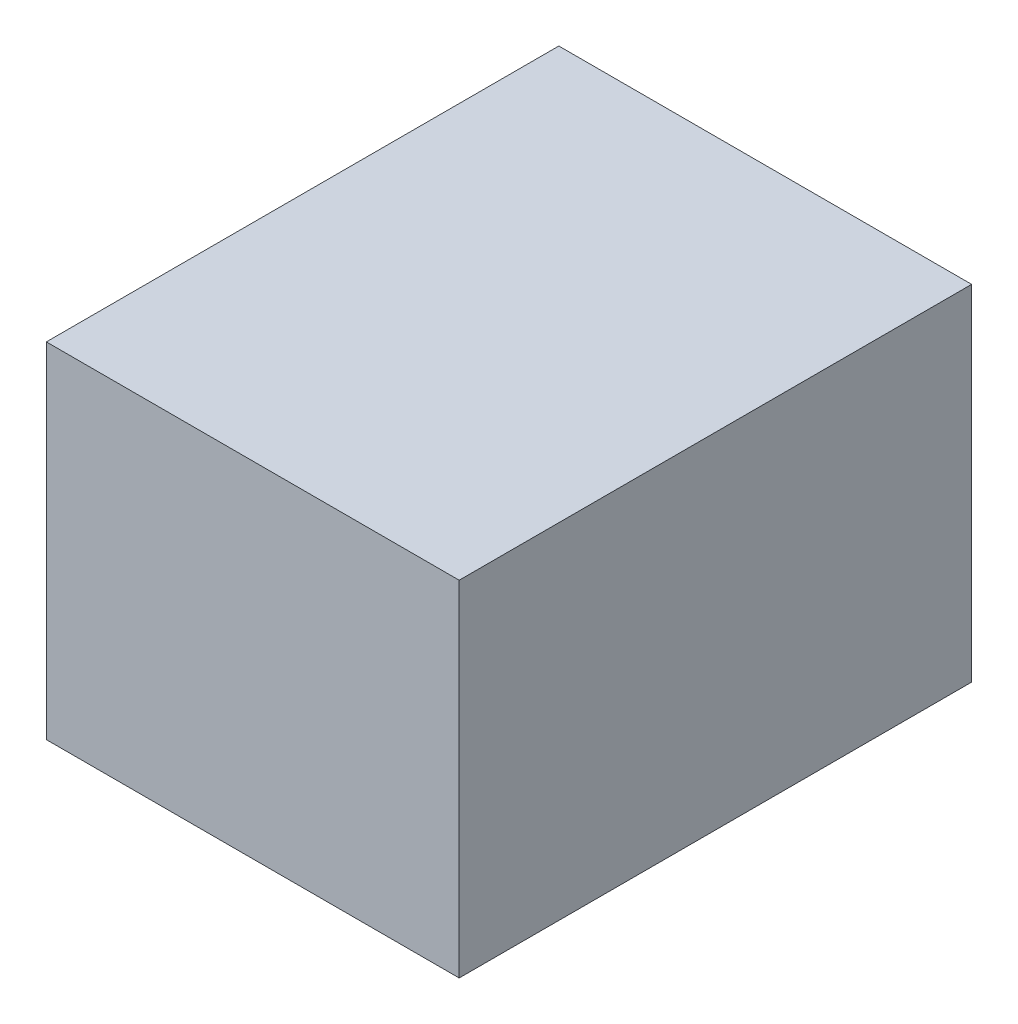
ISO-10303-21;
HEADER;
FILE_DESCRIPTION(('STEP AP214'),'2;1');
FILE_NAME('part.step','',(''),(''),'','','');
FILE_SCHEMA(('AUTOMOTIVE_DESIGN { 1 0 10303 214 1 1 1 1 }'));
ENDSEC;
DATA;
#1=APPLICATION_CONTEXT('core data for automotive mechanical design processes');
#2=APPLICATION_PROTOCOL_DEFINITION('international standard','automotive_design',2000,#1);
#3=PRODUCT_CONTEXT('',#1,'mechanical');
#4=PRODUCT('Part','Part','',(#3));
#5=PRODUCT_RELATED_PRODUCT_CATEGORY('part','',(#4));
#6=PRODUCT_DEFINITION_FORMATION('','',#4);
#7=PRODUCT_DEFINITION_CONTEXT('part definition',#1,'design');
#8=PRODUCT_DEFINITION('design','',#6,#7);
#9=PRODUCT_DEFINITION_SHAPE('','',#8);
#10=(LENGTH_UNIT() NAMED_UNIT(*) SI_UNIT(.MILLI.,.METRE.));
#11=(NAMED_UNIT(*) PLANE_ANGLE_UNIT() SI_UNIT($,.RADIAN.));
#12=(NAMED_UNIT(*) SI_UNIT($,.STERADIAN.) SOLID_ANGLE_UNIT());
#13=UNCERTAINTY_MEASURE_WITH_UNIT(LENGTH_MEASURE(1.E-05),#10,'distance_accuracy_value','');
#14=(GEOMETRIC_REPRESENTATION_CONTEXT(3) GLOBAL_UNCERTAINTY_ASSIGNED_CONTEXT((#13)) GLOBAL_UNIT_ASSIGNED_CONTEXT((#10,
#11,#12)) REPRESENTATION_CONTEXT('',''));
#15=CARTESIAN_POINT('',(0.,0.,0.));
#16=DIRECTION('',(0.,0.,1.));
#17=DIRECTION('',(1.,0.,0.));
#18=AXIS2_PLACEMENT_3D('',#15,#16,#17);
#19=CARTESIAN_POINT('',(-0.72499982,0.60500006,0.));
#20=DIRECTION('',(0.,1.,0.));
#21=DIRECTION('',(0.,0.,1.));
#22=AXIS2_PLACEMENT_3D('',#19,#20,#21);
#23=PLANE('',#22);
#24=DIRECTION('',(0.,0.,-1.));
#25=VECTOR('',#24,1.);
#26=CARTESIAN_POINT('',(0.72499982,0.60500006,0.));
#27=LINE('',#26,#25);
#28=CARTESIAN_POINT('',(0.72499982,0.60500006,0.));
#29=VERTEX_POINT('',#28);
#30=CARTESIAN_POINT('',(0.72499982,0.60500006,1.79999894));
#31=VERTEX_POINT('',#30);
#32=EDGE_CURVE('E61',#29,#31,#27,.F.);
#33=ORIENTED_EDGE('',*,*,#32,.F.);
#34=DIRECTION('',(1.,0.,0.));
#35=VECTOR('',#34,1.);
#36=CARTESIAN_POINT('',(-0.72499982,0.60500006,0.));
#37=LINE('',#36,#35);
#38=CARTESIAN_POINT('',(-0.72499982,0.60500006,0.));
#39=VERTEX_POINT('',#38);
#40=EDGE_CURVE('E19',#29,#39,#37,.F.);
#41=ORIENTED_EDGE('',*,*,#40,.T.);
#42=DIRECTION('',(0.,0.,1.));
#43=VECTOR('',#42,1.);
#44=CARTESIAN_POINT('',(-0.72499982,0.60500006,0.));
#45=LINE('',#44,#43);
#46=CARTESIAN_POINT('',(-0.72499982,0.60500006,1.79999894));
#47=VERTEX_POINT('',#46);
#48=EDGE_CURVE('E68',#47,#39,#45,.F.);
#49=ORIENTED_EDGE('',*,*,#48,.F.);
#50=DIRECTION('',(1.,0.,0.));
#51=VECTOR('',#50,1.);
#52=CARTESIAN_POINT('',(0.72499982,0.60500006,1.79999894));
#53=LINE('',#52,#51);
#54=EDGE_CURVE('E55',#31,#47,#53,.F.);
#55=ORIENTED_EDGE('',*,*,#54,.F.);
#56=EDGE_LOOP('',(#33,#41,#49,#55));
#57=FACE_BOUND('',#56,.T.);
#58=ADVANCED_FACE('F16',(#57),#23,.T.);
#59=CARTESIAN_POINT('',(0.72499982,0.60500006,0.));
#60=DIRECTION('',(1.,0.,0.));
#61=DIRECTION('',(0.,0.,-1.));
#62=AXIS2_PLACEMENT_3D('',#59,#60,#61);
#63=PLANE('',#62);
#64=DIRECTION('',(0.,0.,-1.));
#65=VECTOR('',#64,1.);
#66=CARTESIAN_POINT('',(0.72499982,-0.60500006,0.));
#67=LINE('',#66,#65);
#68=CARTESIAN_POINT('',(0.72499982,-0.60500006,0.));
#69=VERTEX_POINT('',#68);
#70=CARTESIAN_POINT('',(0.72499982,-0.60500006,1.79999894));
#71=VERTEX_POINT('',#70);
#72=EDGE_CURVE('E82',#69,#71,#67,.F.);
#73=ORIENTED_EDGE('',*,*,#72,.F.);
#74=DIRECTION('',(0.,1.,0.));
#75=VECTOR('',#74,1.);
#76=CARTESIAN_POINT('',(0.72499982,-0.60500006,0.));
#77=LINE('',#76,#75);
#78=EDGE_CURVE('E66',#69,#29,#77,.T.);
#79=ORIENTED_EDGE('',*,*,#78,.T.);
#80=ORIENTED_EDGE('',*,*,#32,.T.);
#81=DIRECTION('',(0.,1.,0.));
#82=VECTOR('',#81,1.);
#83=CARTESIAN_POINT('',(0.72499982,-0.60500006,1.79999894));
#84=LINE('',#83,#82);
#85=EDGE_CURVE('E63',#71,#31,#84,.T.);
#86=ORIENTED_EDGE('',*,*,#85,.F.);
#87=EDGE_LOOP('',(#73,#79,#80,#86));
#88=FACE_BOUND('',#87,.T.);
#89=ADVANCED_FACE('F62',(#88),#63,.T.);
#90=CARTESIAN_POINT('',(0.72499982,-0.60500006,1.79999894));
#91=DIRECTION('',(0.,0.,1.));
#92=DIRECTION('',(1.,0.,0.));
#93=AXIS2_PLACEMENT_3D('',#90,#91,#92);
#94=PLANE('',#93);
#95=DIRECTION('',(0.,1.,0.));
#96=VECTOR('',#95,1.);
#97=CARTESIAN_POINT('',(-0.72499982,-0.60500006,1.79999894));
#98=LINE('',#97,#96);
#99=CARTESIAN_POINT('',(-0.72499982,-0.60500006,1.79999894));
#100=VERTEX_POINT('',#99);
#101=EDGE_CURVE('E70',#100,#47,#98,.T.);
#102=ORIENTED_EDGE('',*,*,#101,.F.);
#103=DIRECTION('',(1.,0.,0.));
#104=VECTOR('',#103,1.);
#105=CARTESIAN_POINT('',(0.72499982,-0.60500006,1.79999894));
#106=LINE('',#105,#104);
#107=EDGE_CURVE('E74',#71,#100,#106,.F.);
#108=ORIENTED_EDGE('',*,*,#107,.F.);
#109=ORIENTED_EDGE('',*,*,#85,.T.);
#110=ORIENTED_EDGE('',*,*,#54,.T.);
#111=EDGE_LOOP('',(#102,#108,#109,#110));
#112=FACE_BOUND('',#111,.T.);
#113=ADVANCED_FACE('F72',(#112),#94,.T.);
#114=CARTESIAN_POINT('',(-0.72499982,-0.60500006,0.));
#115=DIRECTION('',(-1.,0.,0.));
#116=DIRECTION('',(0.,0.,1.));
#117=AXIS2_PLACEMENT_3D('',#114,#115,#116);
#118=PLANE('',#117);
#119=ORIENTED_EDGE('',*,*,#48,.T.);
#120=DIRECTION('',(0.,1.,0.));
#121=VECTOR('',#120,1.);
#122=CARTESIAN_POINT('',(-0.72499982,-0.60500006,0.));
#123=LINE('',#122,#121);
#124=CARTESIAN_POINT('',(-0.72499982,-0.60500006,0.));
#125=VERTEX_POINT('',#124);
#126=EDGE_CURVE('E34',#39,#125,#123,.F.);
#127=ORIENTED_EDGE('',*,*,#126,.T.);
#128=DIRECTION('',(0.,0.,-1.));
#129=VECTOR('',#128,1.);
#130=CARTESIAN_POINT('',(-0.72499982,-0.60500006,0.));
#131=LINE('',#130,#129);
#132=EDGE_CURVE('E25',#100,#125,#131,.T.);
#133=ORIENTED_EDGE('',*,*,#132,.F.);
#134=ORIENTED_EDGE('',*,*,#101,.T.);
#135=EDGE_LOOP('',(#119,#127,#133,#134));
#136=FACE_BOUND('',#135,.T.);
#137=ADVANCED_FACE('F88',(#136),#118,.T.);
#138=CARTESIAN_POINT('',(0.72499982,-0.60500006,0.));
#139=DIRECTION('',(0.,0.,1.));
#140=DIRECTION('',(1.,0.,0.));
#141=AXIS2_PLACEMENT_3D('',#138,#139,#140);
#142=PLANE('',#141);
#143=ORIENTED_EDGE('',*,*,#126,.F.);
#144=ORIENTED_EDGE('',*,*,#40,.F.);
#145=ORIENTED_EDGE('',*,*,#78,.F.);
#146=DIRECTION('',(1.,0.,0.));
#147=VECTOR('',#146,1.);
#148=CARTESIAN_POINT('',(0.72499982,-0.60500006,0.));
#149=LINE('',#148,#147);
#150=EDGE_CURVE('E11',#125,#69,#149,.T.);
#151=ORIENTED_EDGE('',*,*,#150,.F.);
#152=EDGE_LOOP('',(#143,#144,#145,#151));
#153=FACE_BOUND('',#152,.T.);
#154=ADVANCED_FACE('F90',(#153),#142,.F.);
#155=CARTESIAN_POINT('',(0.72499982,-0.60500006,0.));
#156=DIRECTION('',(0.,-1.,0.));
#157=DIRECTION('',(0.,0.,-1.));
#158=AXIS2_PLACEMENT_3D('',#155,#156,#157);
#159=PLANE('',#158);
#160=ORIENTED_EDGE('',*,*,#132,.T.);
#161=ORIENTED_EDGE('',*,*,#150,.T.);
#162=ORIENTED_EDGE('',*,*,#72,.T.);
#163=ORIENTED_EDGE('',*,*,#107,.T.);
#164=EDGE_LOOP('',(#160,#161,#162,#163));
#165=FACE_BOUND('',#164,.T.);
#166=ADVANCED_FACE('F87',(#165),#159,.T.);
#167=CLOSED_SHELL('',(#58,#89,#113,#137,#154,#166));
#168=MANIFOLD_SOLID_BREP('B1',#167);
#169=ADVANCED_BREP_SHAPE_REPRESENTATION('',(#18,#168),#14);
#170=SHAPE_DEFINITION_REPRESENTATION(#9,#169);
ENDSEC;
END-ISO-10303-21;
